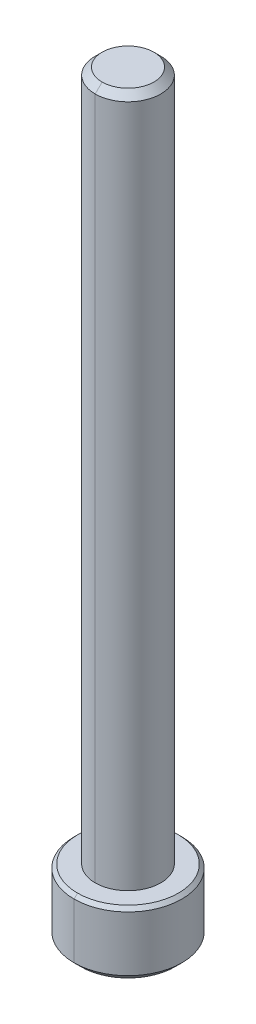
ISO-10303-21;
HEADER;
FILE_DESCRIPTION(('STEP AP214'),'2;1');
FILE_NAME('part.step','',(''),(''),'','','');
FILE_SCHEMA(('AUTOMOTIVE_DESIGN { 1 0 10303 214 1 1 1 1 }'));
ENDSEC;
DATA;
#1=APPLICATION_CONTEXT('core data for automotive mechanical design processes');
#2=APPLICATION_PROTOCOL_DEFINITION('international standard','automotive_design',2000,#1);
#3=PRODUCT_CONTEXT('',#1,'mechanical');
#4=PRODUCT('Part','Part','',(#3));
#5=PRODUCT_RELATED_PRODUCT_CATEGORY('part','',(#4));
#6=PRODUCT_DEFINITION_FORMATION('','',#4);
#7=PRODUCT_DEFINITION_CONTEXT('part definition',#1,'design');
#8=PRODUCT_DEFINITION('design','',#6,#7);
#9=PRODUCT_DEFINITION_SHAPE('','',#8);
#10=(LENGTH_UNIT() NAMED_UNIT(*) SI_UNIT(.MILLI.,.METRE.));
#11=(NAMED_UNIT(*) PLANE_ANGLE_UNIT() SI_UNIT($,.RADIAN.));
#12=(NAMED_UNIT(*) SI_UNIT($,.STERADIAN.) SOLID_ANGLE_UNIT());
#13=UNCERTAINTY_MEASURE_WITH_UNIT(LENGTH_MEASURE(1.E-05),#10,'distance_accuracy_value','');
#14=(GEOMETRIC_REPRESENTATION_CONTEXT(3) GLOBAL_UNCERTAINTY_ASSIGNED_CONTEXT((#13)) GLOBAL_UNIT_ASSIGNED_CONTEXT((#10,
#11,#12)) REPRESENTATION_CONTEXT('',''));
#15=CARTESIAN_POINT('',(0.,0.,0.));
#16=DIRECTION('',(0.,0.,1.));
#17=DIRECTION('',(1.,0.,0.));
#18=AXIS2_PLACEMENT_3D('',#15,#16,#17);
#19=CARTESIAN_POINT('',(0.,-0.254,0.));
#20=DIRECTION('',(0.,-1.,0.));
#21=DIRECTION('',(0.,0.,-1.));
#22=AXIS2_PLACEMENT_3D('',#19,#20,#21);
#23=CONICAL_SURFACE('',#22,3.96875,0.785398163397448);
#24=DIRECTION('',(0.,-0.707106781186548,0.707106781186548));
#25=VECTOR('',#24,1.);
#26=CARTESIAN_POINT('',(0.,-0.254,3.96875));
#27=LINE('',#26,#25);
#28=CARTESIAN_POINT('',(0.,0.,3.71475));
#29=VERTEX_POINT('',#28);
#30=CARTESIAN_POINT('',(0.,-0.254,3.96875));
#31=VERTEX_POINT('',#30);
#32=EDGE_CURVE('E422',#29,#31,#27,.T.);
#33=ORIENTED_EDGE('',*,*,#32,.F.);
#34=CARTESIAN_POINT('',(0.,0.,0.));
#35=DIRECTION('',(0.,1.,0.));
#36=DIRECTION('',(0.,0.,-1.));
#37=AXIS2_PLACEMENT_3D('',#34,#35,#36);
#38=CIRCLE('',#37,3.71475);
#39=CARTESIAN_POINT('',(0.,0.,-3.71475));
#40=VERTEX_POINT('',#39);
#41=EDGE_CURVE('E425',#40,#29,#38,.T.);
#42=ORIENTED_EDGE('',*,*,#41,.F.);
#43=DIRECTION('',(0.,-0.707106781186548,-0.707106781186548));
#44=VECTOR('',#43,1.);
#45=CARTESIAN_POINT('',(0.,-0.254,-3.96875));
#46=LINE('',#45,#44);
#47=CARTESIAN_POINT('',(0.,-0.254,-3.96875));
#48=VERTEX_POINT('',#47);
#49=EDGE_CURVE('E436',#40,#48,#46,.T.);
#50=ORIENTED_EDGE('',*,*,#49,.T.);
#51=CARTESIAN_POINT('',(0.,-0.254,0.));
#52=DIRECTION('',(0.,-1.,0.));
#53=DIRECTION('',(0.,0.,-1.));
#54=AXIS2_PLACEMENT_3D('',#51,#52,#53);
#55=CIRCLE('',#54,3.96875);
#56=EDGE_CURVE('E427',#31,#48,#55,.T.);
#57=ORIENTED_EDGE('',*,*,#56,.F.);
#58=EDGE_LOOP('',(#33,#42,#50,#57));
#59=FACE_BOUND('',#58,.T.);
#60=ADVANCED_FACE('F16',(#59),#23,.T.);
#61=CARTESIAN_POINT('',(0.,-4.826,0.));
#62=DIRECTION('',(0.,1.,0.));
#63=DIRECTION('',(0.,0.,1.));
#64=AXIS2_PLACEMENT_3D('',#61,#62,#63);
#65=CONICAL_SURFACE('',#64,3.46075,0.785398163397448);
#66=DIRECTION('',(0.,0.707106781186548,-0.707106781186548));
#67=VECTOR('',#66,1.);
#68=CARTESIAN_POINT('',(0.,-4.826,-3.46075));
#69=LINE('',#68,#67);
#70=CARTESIAN_POINT('',(0.,-4.826,-3.46075));
#71=VERTEX_POINT('',#70);
#72=CARTESIAN_POINT('',(0.,-4.318,-3.96875));
#73=VERTEX_POINT('',#72);
#74=EDGE_CURVE('E893',#71,#73,#69,.T.);
#75=ORIENTED_EDGE('',*,*,#74,.F.);
#76=CARTESIAN_POINT('',(0.,-4.826,0.));
#77=DIRECTION('',(0.,-1.,0.));
#78=DIRECTION('',(0.,0.,-1.));
#79=AXIS2_PLACEMENT_3D('',#76,#77,#78);
#80=CIRCLE('',#79,3.46075);
#81=CARTESIAN_POINT('',(0.,-4.826,3.46075));
#82=VERTEX_POINT('',#81);
#83=EDGE_CURVE('E114',#82,#71,#80,.T.);
#84=ORIENTED_EDGE('',*,*,#83,.F.);
#85=DIRECTION('',(0.,0.707106781186548,0.707106781186548));
#86=VECTOR('',#85,1.);
#87=CARTESIAN_POINT('',(0.,-4.826,3.46075));
#88=LINE('',#87,#86);
#89=CARTESIAN_POINT('',(0.,-4.318,3.96875));
#90=VERTEX_POINT('',#89);
#91=EDGE_CURVE('E475',#82,#90,#88,.T.);
#92=ORIENTED_EDGE('',*,*,#91,.T.);
#93=CARTESIAN_POINT('',(0.,-4.318,0.));
#94=DIRECTION('',(0.,1.,0.));
#95=DIRECTION('',(0.,0.,-1.));
#96=AXIS2_PLACEMENT_3D('',#93,#94,#95);
#97=CIRCLE('',#96,3.96875);
#98=EDGE_CURVE('E492',#73,#90,#97,.T.);
#99=ORIENTED_EDGE('',*,*,#98,.F.);
#100=EDGE_LOOP('',(#75,#84,#92,#99));
#101=FACE_BOUND('',#100,.T.);
#102=ADVANCED_FACE('F250',(#101),#65,.T.);
#103=CARTESIAN_POINT('',(1.984375,-1.8494248,-1.14567944042316));
#104=DIRECTION('',(1.,0.,0.));
#105=DIRECTION('',(0.,0.,-1.));
#106=AXIS2_PLACEMENT_3D('',#103,#104,#105);
#107=PLANE('',#106);
#108=DIRECTION('',(0.,-1.,0.));
#109=VECTOR('',#108,1.);
#110=CARTESIAN_POINT('',(1.984375,-1.8494248,-1.14567944042316));
#111=LINE('',#110,#109);
#112=CARTESIAN_POINT('',(1.984375,-1.8494248,-1.14567944042316));
#113=VERTEX_POINT('',#112);
#114=CARTESIAN_POINT('',(1.984375,-4.826,-1.14567944042316));
#115=VERTEX_POINT('',#114);
#116=EDGE_CURVE('E11',#113,#115,#111,.T.);
#117=ORIENTED_EDGE('',*,*,#116,.T.);
#118=CARTESIAN_POINT('',(1.984375,-4.826,-1.14567944042316));
#119=CARTESIAN_POINT('',(1.984375,-4.68036208510538,-0.854403610634551));
#120=CARTESIAN_POINT('',(1.984375,-4.60506326337506,-0.590680721420027));
#121=CARTESIAN_POINT('',(1.984375,-4.51924433500676,-0.29011272820971));
#122=CARTESIAN_POINT('',(1.984375,-4.51901637621626,-0.00101005810057195));
#123=CARTESIAN_POINT('',(1.984375,-4.51878865540112,0.287790806093884));
#124=CARTESIAN_POINT('',(1.984375,-4.60492537223951,0.590197211066081));
#125=CARTESIAN_POINT('',(1.984375,-4.67994195088672,0.853563342196651));
#126=CARTESIAN_POINT('',(1.984375,-4.826,1.14567944042317));
#127=B_SPLINE_CURVE_WITH_KNOTS('',2,(#118,#119,#120,#121,#122,#123,#124,#125,#126),
.UNSPECIFIED.,.F.,.F.,(3,2,2,2,3),(0.,0.25,0.5,0.75,1.),.UNSPECIFIED.);
#128=CARTESIAN_POINT('',(1.984375,-4.826,1.14567944042316));
#129=VERTEX_POINT('',#128);
#130=EDGE_CURVE('E267',#115,#129,#127,.T.);
#131=ORIENTED_EDGE('',*,*,#130,.T.);
#132=DIRECTION('',(0.,-1.,0.));
#133=VECTOR('',#132,1.);
#134=CARTESIAN_POINT('',(1.984375,-1.8494248,1.14567944042316));
#135=LINE('',#134,#133);
#136=CARTESIAN_POINT('',(1.984375,-1.8494248,1.14567944042316));
#137=VERTEX_POINT('',#136);
#138=EDGE_CURVE('E345',#137,#129,#135,.T.);
#139=ORIENTED_EDGE('',*,*,#138,.F.);
#140=DIRECTION('',(0.,0.,1.));
#141=VECTOR('',#140,1.);
#142=CARTESIAN_POINT('',(1.984375,-1.8494248,-1.14567944042316));
#143=LINE('',#142,#141);
#144=EDGE_CURVE('E446',#113,#137,#143,.T.);
#145=ORIENTED_EDGE('',*,*,#144,.F.);
#146=EDGE_LOOP('',(#117,#131,#139,#145));
#147=FACE_BOUND('',#146,.T.);
#148=ADVANCED_FACE('F245',(#147),#107,.F.);
#149=CARTESIAN_POINT('',(0.,-1.8494248,-2.29135888084633));
#150=DIRECTION('',(0.5,0.,-0.866025403784439));
#151=DIRECTION('',(0.,-1.,0.));
#152=AXIS2_PLACEMENT_3D('',#149,#150,#151);
#153=PLANE('',#152);
#154=DIRECTION('',(0.,-1.,0.));
#155=VECTOR('',#154,1.);
#156=CARTESIAN_POINT('',(0.,-1.8494248,-2.29135888084633));
#157=LINE('',#156,#155);
#158=CARTESIAN_POINT('',(0.,-1.8494248,-2.29135888084633));
#159=VERTEX_POINT('',#158);
#160=CARTESIAN_POINT('',(0.,-4.826,-2.29135888084633));
#161=VERTEX_POINT('',#160);
#162=EDGE_CURVE('E28',#159,#161,#157,.T.);
#163=ORIENTED_EDGE('',*,*,#162,.T.);
#164=CARTESIAN_POINT('',(0.,-4.826,-2.29135888084633));
#165=CARTESIAN_POINT('',(0.250705601837018,-4.68125505329205,-2.14661393413838));
#166=CARTESIAN_POINT('',(0.477795416201183,-4.60600373712399,-2.01550356868501));
#167=CARTESIAN_POINT('',(0.738188216368874,-4.51971672778291,-1.86516571541315));
#168=CARTESIAN_POINT('',(0.98853321615525,-4.51902060546134,-1.72062896239621));
#169=CARTESIAN_POINT('',(1.23842353131887,-4.51832574745947,-1.57635472166861));
#170=CARTESIAN_POINT('',(1.49993800055402,-4.60381766270318,-1.42536927245872));
#171=CARTESIAN_POINT('',(1.72956436293042,-4.67888501009477,-1.29279443032767));
#172=CARTESIAN_POINT('',(1.984375,-4.826,-1.14567944042316));
#173=B_SPLINE_CURVE_WITH_KNOTS('',2,(#164,#165,#166,#167,#168,#169,#170,#171,#172),
.UNSPECIFIED.,.F.,.F.,(3,2,2,2,3),(0.,0.25,0.5,0.75,1.),.UNSPECIFIED.);
#174=EDGE_CURVE('E390',#161,#115,#173,.T.);
#175=ORIENTED_EDGE('',*,*,#174,.T.);
#176=ORIENTED_EDGE('',*,*,#116,.F.);
#177=DIRECTION('',(0.866025403784439,0.,0.5));
#178=VECTOR('',#177,1.);
#179=CARTESIAN_POINT('',(0.,-1.8494248,-2.29135888084633));
#180=LINE('',#179,#178);
#181=EDGE_CURVE('E450',#159,#113,#180,.T.);
#182=ORIENTED_EDGE('',*,*,#181,.F.);
#183=EDGE_LOOP('',(#163,#175,#176,#182));
#184=FACE_BOUND('',#183,.T.);
#185=ADVANCED_FACE('F249',(#184),#153,.F.);
#186=CARTESIAN_POINT('',(-1.984375,-1.8494248,-1.14567944042316));
#187=DIRECTION('',(-0.5,0.,-0.866025403784439));
#188=DIRECTION('',(-0.866025403784439,0.,0.5));
#189=AXIS2_PLACEMENT_3D('',#186,#187,#188);
#190=PLANE('',#189);
#191=DIRECTION('',(0.,-1.,0.));
#192=VECTOR('',#191,1.);
#193=CARTESIAN_POINT('',(-1.984375,-1.8494248,-1.14567944042316));
#194=LINE('',#193,#192);
#195=CARTESIAN_POINT('',(-1.984375,-1.8494248,-1.14567944042316));
#196=VERTEX_POINT('',#195);
#197=CARTESIAN_POINT('',(-1.984375,-4.826,-1.14567944042316));
#198=VERTEX_POINT('',#197);
#199=EDGE_CURVE('E159',#196,#198,#194,.T.);
#200=ORIENTED_EDGE('',*,*,#199,.T.);
#201=CARTESIAN_POINT('',(-1.984375,-4.826,-1.14567944042316));
#202=CARTESIAN_POINT('',(-1.73366939816202,-4.6812550532915,-1.29042438713167));
#203=CARTESIAN_POINT('',(-1.50657958379882,-4.606003737124,-1.42153475258448));
#204=CARTESIAN_POINT('',(-1.24618678363029,-4.51971672778291,-1.57187260585682));
#205=CARTESIAN_POINT('',(-0.99584178384475,-4.51902060546134,-1.71640935887328));
#206=CARTESIAN_POINT('',(-0.745951468679565,-4.51832574745947,-1.86068359960178));
#207=CARTESIAN_POINT('',(-0.484436999445984,-4.60381766270318,-2.01166904881077));
#208=CARTESIAN_POINT('',(-0.254810637067759,-4.67888501009583,-2.14424389094287));
#209=CARTESIAN_POINT('',(0.,-4.826,-2.29135888084632));
#210=B_SPLINE_CURVE_WITH_KNOTS('',2,(#201,#202,#203,#204,#205,#206,#207,#208,#209),
.UNSPECIFIED.,.F.,.F.,(3,2,2,2,3),(0.,0.25,0.5,0.75,1.),.UNSPECIFIED.);
#211=EDGE_CURVE('E189',#198,#161,#210,.T.);
#212=ORIENTED_EDGE('',*,*,#211,.T.);
#213=ORIENTED_EDGE('',*,*,#162,.F.);
#214=DIRECTION('',(0.866025403784439,0.,-0.5));
#215=VECTOR('',#214,1.);
#216=CARTESIAN_POINT('',(-1.984375,-1.8494248,-1.14567944042316));
#217=LINE('',#216,#215);
#218=EDGE_CURVE('E454',#196,#159,#217,.T.);
#219=ORIENTED_EDGE('',*,*,#218,.F.);
#220=EDGE_LOOP('',(#200,#212,#213,#219));
#221=FACE_BOUND('',#220,.T.);
#222=ADVANCED_FACE('F242',(#221),#190,.F.);
#223=CARTESIAN_POINT('',(-1.984375,-1.8494248,1.14567944042316));
#224=DIRECTION('',(-1.,0.,0.));
#225=DIRECTION('',(0.,0.,1.));
#226=AXIS2_PLACEMENT_3D('',#223,#224,#225);
#227=PLANE('',#226);
#228=DIRECTION('',(0.,-1.,0.));
#229=VECTOR('',#228,1.);
#230=CARTESIAN_POINT('',(-1.984375,-1.8494248,1.14567944042316));
#231=LINE('',#230,#229);
#232=CARTESIAN_POINT('',(-1.984375,-1.8494248,1.14567944042316));
#233=VERTEX_POINT('',#232);
#234=CARTESIAN_POINT('',(-1.984375,-4.826,1.14567944042316));
#235=VERTEX_POINT('',#234);
#236=EDGE_CURVE('E167',#233,#235,#231,.T.);
#237=ORIENTED_EDGE('',*,*,#236,.T.);
#238=CARTESIAN_POINT('',(-1.984375,-4.826,1.14567944042316));
#239=CARTESIAN_POINT('',(-1.984375,-4.68036208510536,0.854403610634491));
#240=CARTESIAN_POINT('',(-1.984375,-4.60506326337506,0.590680721420027));
#241=CARTESIAN_POINT('',(-1.984375,-4.51924433500676,0.290112728209678));
#242=CARTESIAN_POINT('',(-1.984375,-4.51901637621626,0.00101005810056978));
#243=CARTESIAN_POINT('',(-1.984375,-4.51878865540112,-0.287790806093884));
#244=CARTESIAN_POINT('',(-1.984375,-4.60492537223951,-0.590197211066078));
#245=CARTESIAN_POINT('',(-1.984375,-4.67994195088672,-0.853563342196648));
#246=CARTESIAN_POINT('',(-1.984375,-4.826,-1.14567944042316));
#247=B_SPLINE_CURVE_WITH_KNOTS('',2,(#238,#239,#240,#241,#242,#243,#244,#245,#246),
.UNSPECIFIED.,.F.,.F.,(3,2,2,2,3),(0.,0.25,0.5,0.75,1.),.UNSPECIFIED.);
#248=EDGE_CURVE('E170',#235,#198,#247,.T.);
#249=ORIENTED_EDGE('',*,*,#248,.T.);
#250=ORIENTED_EDGE('',*,*,#199,.F.);
#251=DIRECTION('',(0.,0.,-1.));
#252=VECTOR('',#251,1.);
#253=CARTESIAN_POINT('',(-1.984375,-1.8494248,1.14567944042316));
#254=LINE('',#253,#252);
#255=EDGE_CURVE('E174',#233,#196,#254,.T.);
#256=ORIENTED_EDGE('',*,*,#255,.F.);
#257=EDGE_LOOP('',(#237,#249,#250,#256));
#258=FACE_BOUND('',#257,.T.);
#259=ADVANCED_FACE('F169',(#258),#227,.F.);
#260=CARTESIAN_POINT('',(0.,-1.8494248,2.29135888084633));
#261=DIRECTION('',(-0.5,0.,0.866025403784439));
#262=DIRECTION('',(0.,1.,0.));
#263=AXIS2_PLACEMENT_3D('',#260,#261,#262);
#264=PLANE('',#263);
#265=DIRECTION('',(0.,-1.,0.));
#266=VECTOR('',#265,1.);
#267=CARTESIAN_POINT('',(0.,-1.8494248,2.29135888084633));
#268=LINE('',#267,#266);
#269=CARTESIAN_POINT('',(0.,-1.8494248,2.29135888084633));
#270=VERTEX_POINT('',#269);
#271=CARTESIAN_POINT('',(0.,-4.826,2.29135888084633));
#272=VERTEX_POINT('',#271);
#273=EDGE_CURVE('E180',#270,#272,#268,.T.);
#274=ORIENTED_EDGE('',*,*,#273,.T.);
#275=CARTESIAN_POINT('',(0.,-4.826,2.29135888084633));
#276=CARTESIAN_POINT('',(-0.250705601836271,-4.68125505329248,2.14661393413881));
#277=CARTESIAN_POINT('',(-0.477795416201183,-4.606003737124,2.01550356868501));
#278=CARTESIAN_POINT('',(-0.738188216366829,-4.51971672778338,1.86516571541433));
#279=CARTESIAN_POINT('',(-0.988533216155249,-4.51902060546134,1.72062896239621));
#280=CARTESIAN_POINT('',(-1.23842353131898,-4.518325747459,1.57635472166855));
#281=CARTESIAN_POINT('',(-1.49993800055402,-4.60381766270318,1.42536927245872));
#282=CARTESIAN_POINT('',(-1.72956436293218,-4.67888501009579,1.29279443032665));
#283=CARTESIAN_POINT('',(-1.984375,-4.826,1.14567944042316));
#284=B_SPLINE_CURVE_WITH_KNOTS('',2,(#275,#276,#277,#278,#279,#280,#281,#282,#283),
.UNSPECIFIED.,.F.,.F.,(3,2,2,2,3),(0.,0.25,0.5,0.75,1.),.UNSPECIFIED.);
#285=EDGE_CURVE('E190',#272,#235,#284,.T.);
#286=ORIENTED_EDGE('',*,*,#285,.T.);
#287=ORIENTED_EDGE('',*,*,#236,.F.);
#288=DIRECTION('',(-0.866025403784439,0.,-0.5));
#289=VECTOR('',#288,1.);
#290=CARTESIAN_POINT('',(0.,-1.8494248,2.29135888084633));
#291=LINE('',#290,#289);
#292=EDGE_CURVE('E491',#270,#233,#291,.T.);
#293=ORIENTED_EDGE('',*,*,#292,.F.);
#294=EDGE_LOOP('',(#274,#286,#287,#293));
#295=FACE_BOUND('',#294,.T.);
#296=ADVANCED_FACE('F196',(#295),#264,.F.);
#297=CARTESIAN_POINT('',(1.984375,-1.8494248,1.14567944042316));
#298=DIRECTION('',(0.5,0.,0.866025403784438));
#299=DIRECTION('',(0.,-1.,0.));
#300=AXIS2_PLACEMENT_3D('',#297,#298,#299);
#301=PLANE('',#300);
#302=ORIENTED_EDGE('',*,*,#138,.T.);
#303=CARTESIAN_POINT('',(1.984375,-4.826,1.14567944042316));
#304=CARTESIAN_POINT('',(1.73366939816205,-4.68125505329151,1.29042438713165));
#305=CARTESIAN_POINT('',(1.50657958379882,-4.606003737124,1.42153475258448));
#306=CARTESIAN_POINT('',(1.24618678363103,-4.51971672778314,1.5718726058564));
#307=CARTESIAN_POINT('',(0.995841783844754,-4.51902060546134,1.71640935887328));
#308=CARTESIAN_POINT('',(0.745951468680323,-4.51832574745923,1.86068359960134));
#309=CARTESIAN_POINT('',(0.484436999445986,-4.60381766270318,2.01166904881077));
#310=CARTESIAN_POINT('',(0.254810637067813,-4.67888501009579,2.14424389094284));
#311=CARTESIAN_POINT('',(0.,-4.826,2.29135888084632));
#312=B_SPLINE_CURVE_WITH_KNOTS('',2,(#303,#304,#305,#306,#307,#308,#309,#310,#311),
.UNSPECIFIED.,.F.,.F.,(3,2,2,2,3),(0.,0.25,0.5,0.75,1.),.UNSPECIFIED.);
#313=EDGE_CURVE('E201',#129,#272,#312,.T.);
#314=ORIENTED_EDGE('',*,*,#313,.T.);
#315=ORIENTED_EDGE('',*,*,#273,.F.);
#316=DIRECTION('',(-0.866025403784439,0.,0.5));
#317=VECTOR('',#316,1.);
#318=CARTESIAN_POINT('',(1.984375,-1.8494248,1.14567944042316));
#319=LINE('',#318,#317);
#320=EDGE_CURVE('E526',#137,#270,#319,.T.);
#321=ORIENTED_EDGE('',*,*,#320,.F.);
#322=EDGE_LOOP('',(#302,#314,#315,#321));
#323=FACE_BOUND('',#322,.T.);
#324=ADVANCED_FACE('F326',(#323),#301,.F.);
#325=CARTESIAN_POINT('',(0.,-1.8494248,0.));
#326=DIRECTION('',(0.,-1.,0.));
#327=DIRECTION('',(0.,0.,-1.));
#328=AXIS2_PLACEMENT_3D('',#325,#326,#327);
#329=PLANE('',#328);
#330=ORIENTED_EDGE('',*,*,#144,.T.);
#331=ORIENTED_EDGE('',*,*,#320,.T.);
#332=ORIENTED_EDGE('',*,*,#292,.T.);
#333=ORIENTED_EDGE('',*,*,#255,.T.);
#334=ORIENTED_EDGE('',*,*,#218,.T.);
#335=ORIENTED_EDGE('',*,*,#181,.T.);
#336=EDGE_LOOP('',(#330,#331,#332,#333,#334,#335));
#337=FACE_BOUND('',#336,.T.);
#338=ADVANCED_FACE('F283',(#337),#329,.T.);
#339=CARTESIAN_POINT('',(0.,-4.826,0.));
#340=DIRECTION('',(0.,-1.,0.));
#341=DIRECTION('',(0.,0.,-1.));
#342=AXIS2_PLACEMENT_3D('',#339,#340,#341);
#343=CONICAL_SURFACE('',#342,2.29135888084632,0.78539816339745);
#344=CARTESIAN_POINT('',(0.,-4.826,0.));
#345=DIRECTION('',(0.,-1.,0.));
#346=DIRECTION('',(0.,0.,-1.));
#347=AXIS2_PLACEMENT_3D('',#344,#345,#346);
#348=CIRCLE('',#347,2.29135888084632);
#349=EDGE_CURVE('E496',#115,#129,#348,.T.);
#350=ORIENTED_EDGE('',*,*,#349,.T.);
#351=ORIENTED_EDGE('',*,*,#130,.F.);
#352=EDGE_LOOP('',(#350,#351));
#353=FACE_BOUND('',#352,.T.);
#354=ADVANCED_FACE('F272',(#353),#343,.F.);
#355=CARTESIAN_POINT('',(0.,-4.826,0.));
#356=DIRECTION('',(0.,-1.,0.));
#357=DIRECTION('',(0.,0.,-1.));
#358=AXIS2_PLACEMENT_3D('',#355,#356,#357);
#359=CONICAL_SURFACE('',#358,2.29135888084632,0.78539816339745);
#360=CARTESIAN_POINT('',(0.,-4.826,0.));
#361=DIRECTION('',(0.,-1.,0.));
#362=DIRECTION('',(0.,0.,-1.));
#363=AXIS2_PLACEMENT_3D('',#360,#361,#362);
#364=CIRCLE('',#363,2.29135888084632);
#365=EDGE_CURVE('E223',#161,#115,#364,.T.);
#366=ORIENTED_EDGE('',*,*,#365,.T.);
#367=ORIENTED_EDGE('',*,*,#174,.F.);
#368=EDGE_LOOP('',(#366,#367));
#369=FACE_BOUND('',#368,.T.);
#370=ADVANCED_FACE('F282',(#369),#359,.F.);
#371=CARTESIAN_POINT('',(0.,-4.826,0.));
#372=DIRECTION('',(0.,-1.,0.));
#373=DIRECTION('',(0.,0.,-1.));
#374=AXIS2_PLACEMENT_3D('',#371,#372,#373);
#375=CONICAL_SURFACE('',#374,2.29135888084632,0.78539816339745);
#376=CARTESIAN_POINT('',(0.,-4.826,0.));
#377=DIRECTION('',(0.,-1.,0.));
#378=DIRECTION('',(0.,0.,-1.));
#379=AXIS2_PLACEMENT_3D('',#376,#377,#378);
#380=CIRCLE('',#379,2.29135888084632);
#381=EDGE_CURVE('E215',#198,#161,#380,.T.);
#382=ORIENTED_EDGE('',*,*,#381,.T.);
#383=ORIENTED_EDGE('',*,*,#211,.F.);
#384=EDGE_LOOP('',(#382,#383));
#385=FACE_BOUND('',#384,.T.);
#386=ADVANCED_FACE('F310',(#385),#375,.F.);
#387=CARTESIAN_POINT('',(0.,-4.826,0.));
#388=DIRECTION('',(0.,-1.,0.));
#389=DIRECTION('',(0.,0.,-1.));
#390=AXIS2_PLACEMENT_3D('',#387,#388,#389);
#391=CONICAL_SURFACE('',#390,2.29135888084632,0.78539816339745);
#392=CARTESIAN_POINT('',(0.,-4.826,0.));
#393=DIRECTION('',(0.,-1.,0.));
#394=DIRECTION('',(0.,0.,-1.));
#395=AXIS2_PLACEMENT_3D('',#392,#393,#394);
#396=CIRCLE('',#395,2.29135888084632);
#397=EDGE_CURVE('E186',#235,#198,#396,.T.);
#398=ORIENTED_EDGE('',*,*,#397,.T.);
#399=ORIENTED_EDGE('',*,*,#248,.F.);
#400=EDGE_LOOP('',(#398,#399));
#401=FACE_BOUND('',#400,.T.);
#402=ADVANCED_FACE('F184',(#401),#391,.F.);
#403=CARTESIAN_POINT('',(0.,-4.826,0.));
#404=DIRECTION('',(0.,-1.,0.));
#405=DIRECTION('',(0.,0.,-1.));
#406=AXIS2_PLACEMENT_3D('',#403,#404,#405);
#407=CONICAL_SURFACE('',#406,2.29135888084632,0.78539816339745);
#408=CARTESIAN_POINT('',(0.,-4.826,0.));
#409=DIRECTION('',(0.,-1.,0.));
#410=DIRECTION('',(0.,0.,-1.));
#411=AXIS2_PLACEMENT_3D('',#408,#409,#410);
#412=CIRCLE('',#411,2.29135888084632);
#413=EDGE_CURVE('E205',#272,#235,#412,.T.);
#414=ORIENTED_EDGE('',*,*,#413,.T.);
#415=ORIENTED_EDGE('',*,*,#285,.F.);
#416=EDGE_LOOP('',(#414,#415));
#417=FACE_BOUND('',#416,.T.);
#418=ADVANCED_FACE('F206',(#417),#407,.F.);
#419=CARTESIAN_POINT('',(0.,-4.826,0.));
#420=DIRECTION('',(0.,-1.,0.));
#421=DIRECTION('',(0.,0.,-1.));
#422=AXIS2_PLACEMENT_3D('',#419,#420,#421);
#423=CONICAL_SURFACE('',#422,2.29135888084632,0.78539816339745);
#424=CARTESIAN_POINT('',(0.,-4.826,0.));
#425=DIRECTION('',(0.,-1.,0.));
#426=DIRECTION('',(0.,0.,-1.));
#427=AXIS2_PLACEMENT_3D('',#424,#425,#426);
#428=CIRCLE('',#427,2.29135888084632);
#429=EDGE_CURVE('E210',#129,#272,#428,.T.);
#430=ORIENTED_EDGE('',*,*,#429,.T.);
#431=ORIENTED_EDGE('',*,*,#313,.F.);
#432=EDGE_LOOP('',(#430,#431));
#433=FACE_BOUND('',#432,.T.);
#434=ADVANCED_FACE('F405',(#433),#423,.F.);
#435=CARTESIAN_POINT('',(0.,0.,0.));
#436=DIRECTION('',(0.,-1.,0.));
#437=DIRECTION('',(0.,0.,-1.));
#438=AXIS2_PLACEMENT_3D('',#435,#436,#437);
#439=PLANE('',#438);
#440=CARTESIAN_POINT('',(0.,0.,0.));
#441=DIRECTION('',(0.,1.,0.));
#442=DIRECTION('',(0.,0.,1.));
#443=AXIS2_PLACEMENT_3D('',#440,#441,#442);
#444=CIRCLE('',#443,2.413);
#445=CARTESIAN_POINT('',(0.,0.,-2.413));
#446=VERTEX_POINT('',#445);
#447=CARTESIAN_POINT('',(0.,0.,2.413));
#448=VERTEX_POINT('',#447);
#449=EDGE_CURVE('E871',#446,#448,#444,.T.);
#450=ORIENTED_EDGE('',*,*,#449,.F.);
#451=CARTESIAN_POINT('',(0.,0.,0.));
#452=DIRECTION('',(0.,1.,0.));
#453=DIRECTION('',(0.,0.,1.));
#454=AXIS2_PLACEMENT_3D('',#451,#452,#453);
#455=CIRCLE('',#454,2.413);
#456=EDGE_CURVE('E460',#448,#446,#455,.T.);
#457=ORIENTED_EDGE('',*,*,#456,.F.);
#458=EDGE_LOOP('',(#450,#457));
#459=FACE_BOUND('',#458,.T.);
#460=ORIENTED_EDGE('',*,*,#41,.T.);
#461=CARTESIAN_POINT('',(0.,0.,0.));
#462=DIRECTION('',(0.,1.,0.));
#463=DIRECTION('',(0.,0.,-1.));
#464=AXIS2_PLACEMENT_3D('',#461,#462,#463);
#465=CIRCLE('',#464,3.71475);
#466=EDGE_CURVE('E433',#29,#40,#465,.T.);
#467=ORIENTED_EDGE('',*,*,#466,.T.);
#468=EDGE_LOOP('',(#460,#467));
#469=FACE_BOUND('',#468,.T.);
#470=ADVANCED_FACE('F368',(#459,#469),#439,.F.);
#471=CARTESIAN_POINT('',(0.,-4.826,0.));
#472=DIRECTION('',(0.,-1.,0.));
#473=DIRECTION('',(0.,0.,-1.));
#474=AXIS2_PLACEMENT_3D('',#471,#472,#473);
#475=PLANE('',#474);
#476=ORIENTED_EDGE('',*,*,#365,.F.);
#477=ORIENTED_EDGE('',*,*,#381,.F.);
#478=ORIENTED_EDGE('',*,*,#397,.F.);
#479=ORIENTED_EDGE('',*,*,#413,.F.);
#480=ORIENTED_EDGE('',*,*,#429,.F.);
#481=ORIENTED_EDGE('',*,*,#349,.F.);
#482=EDGE_LOOP('',(#476,#477,#478,#479,#480,#481));
#483=FACE_BOUND('',#482,.T.);
#484=ORIENTED_EDGE('',*,*,#83,.T.);
#485=CARTESIAN_POINT('',(0.,-4.826,0.));
#486=DIRECTION('',(0.,-1.,0.));
#487=DIRECTION('',(0.,0.,-1.));
#488=AXIS2_PLACEMENT_3D('',#485,#486,#487);
#489=CIRCLE('',#488,3.46075);
#490=EDGE_CURVE('E449',#71,#82,#489,.T.);
#491=ORIENTED_EDGE('',*,*,#490,.T.);
#492=EDGE_LOOP('',(#484,#491));
#493=FACE_BOUND('',#492,.T.);
#494=ADVANCED_FACE('F213',(#483,#493),#475,.T.);
#495=CARTESIAN_POINT('',(0.,-4.826,0.));
#496=DIRECTION('',(0.,1.,0.));
#497=DIRECTION('',(0.,0.,1.));
#498=AXIS2_PLACEMENT_3D('',#495,#496,#497);
#499=CYLINDRICAL_SURFACE('',#498,3.96875);
#500=DIRECTION('',(0.,1.,0.));
#501=VECTOR('',#500,1.);
#502=CARTESIAN_POINT('',(0.,-4.826,-3.96875));
#503=LINE('',#502,#501);
#504=EDGE_CURVE('E464',#73,#48,#503,.T.);
#505=ORIENTED_EDGE('',*,*,#504,.F.);
#506=ORIENTED_EDGE('',*,*,#98,.T.);
#507=DIRECTION('',(0.,1.,0.));
#508=VECTOR('',#507,1.);
#509=CARTESIAN_POINT('',(0.,-4.826,3.96875));
#510=LINE('',#509,#508);
#511=EDGE_CURVE('E462',#90,#31,#510,.T.);
#512=ORIENTED_EDGE('',*,*,#511,.T.);
#513=ORIENTED_EDGE('',*,*,#56,.T.);
#514=EDGE_LOOP('',(#505,#506,#512,#513));
#515=FACE_BOUND('',#514,.T.);
#516=ADVANCED_FACE('F367',(#515),#499,.T.);
#517=CARTESIAN_POINT('',(0.,50.8,0.));
#518=DIRECTION('',(0.,-1.,0.));
#519=DIRECTION('',(0.,0.,-1.));
#520=AXIS2_PLACEMENT_3D('',#517,#518,#519);
#521=CONICAL_SURFACE('',#520,1.905,0.78539816339745);
#522=DIRECTION('',(0.,-0.707106781186547,0.707106781186548));
#523=VECTOR('',#522,1.);
#524=CARTESIAN_POINT('',(0.,50.8,1.905));
#525=LINE('',#524,#523);
#526=CARTESIAN_POINT('',(0.,50.8,1.905));
#527=VERTEX_POINT('',#526);
#528=CARTESIAN_POINT('',(0.,50.292,2.413));
#529=VERTEX_POINT('',#528);
#530=EDGE_CURVE('E471',#527,#529,#525,.T.);
#531=ORIENTED_EDGE('',*,*,#530,.F.);
#532=CARTESIAN_POINT('',(0.,50.8,0.));
#533=DIRECTION('',(0.,1.,0.));
#534=DIRECTION('',(0.,0.,1.));
#535=AXIS2_PLACEMENT_3D('',#532,#533,#534);
#536=CIRCLE('',#535,1.905);
#537=CARTESIAN_POINT('',(0.,50.8,-1.905));
#538=VERTEX_POINT('',#537);
#539=EDGE_CURVE('E494',#538,#527,#536,.T.);
#540=ORIENTED_EDGE('',*,*,#539,.F.);
#541=DIRECTION('',(0.,-0.707106781186547,-0.707106781186548));
#542=VECTOR('',#541,1.);
#543=CARTESIAN_POINT('',(0.,50.8,-1.905));
#544=LINE('',#543,#542);
#545=CARTESIAN_POINT('',(0.,50.292,-2.413));
#546=VERTEX_POINT('',#545);
#547=EDGE_CURVE('E461',#538,#546,#544,.T.);
#548=ORIENTED_EDGE('',*,*,#547,.T.);
#549=CARTESIAN_POINT('',(0.,50.292,0.));
#550=DIRECTION('',(0.,-1.,0.));
#551=DIRECTION('',(0.,0.,1.));
#552=AXIS2_PLACEMENT_3D('',#549,#550,#551);
#553=CIRCLE('',#552,2.413);
#554=EDGE_CURVE('E573',#529,#546,#553,.T.);
#555=ORIENTED_EDGE('',*,*,#554,.F.);
#556=EDGE_LOOP('',(#531,#540,#548,#555));
#557=FACE_BOUND('',#556,.T.);
#558=ADVANCED_FACE('F243',(#557),#521,.T.);
#559=CARTESIAN_POINT('',(0.,50.8,0.));
#560=DIRECTION('',(0.,1.,0.));
#561=DIRECTION('',(1.,0.,0.));
#562=AXIS2_PLACEMENT_3D('',#559,#560,#561);
#563=PLANE('',#562);
#564=ORIENTED_EDGE('',*,*,#539,.T.);
#565=CARTESIAN_POINT('',(0.,50.8,0.));
#566=DIRECTION('',(0.,1.,0.));
#567=DIRECTION('',(0.,0.,1.));
#568=AXIS2_PLACEMENT_3D('',#565,#566,#567);
#569=CIRCLE('',#568,1.905);
#570=EDGE_CURVE('E463',#527,#538,#569,.T.);
#571=ORIENTED_EDGE('',*,*,#570,.T.);
#572=EDGE_LOOP('',(#564,#571));
#573=FACE_BOUND('',#572,.T.);
#574=ADVANCED_FACE('F364',(#573),#563,.T.);
#575=CARTESIAN_POINT('',(0.,50.8,0.));
#576=DIRECTION('',(0.,-1.,0.));
#577=DIRECTION('',(0.,0.,-1.));
#578=AXIS2_PLACEMENT_3D('',#575,#576,#577);
#579=CYLINDRICAL_SURFACE('',#578,2.413);
#580=DIRECTION('',(0.,-1.,0.));
#581=VECTOR('',#580,1.);
#582=CARTESIAN_POINT('',(0.,50.8,2.413));
#583=LINE('',#582,#581);
#584=EDGE_CURVE('E458',#529,#448,#583,.T.);
#585=ORIENTED_EDGE('',*,*,#584,.F.);
#586=ORIENTED_EDGE('',*,*,#554,.T.);
#587=DIRECTION('',(0.,-1.,0.));
#588=VECTOR('',#587,1.);
#589=CARTESIAN_POINT('',(0.,50.8,-2.413));
#590=LINE('',#589,#588);
#591=EDGE_CURVE('E569',#546,#446,#590,.T.);
#592=ORIENTED_EDGE('',*,*,#591,.T.);
#593=ORIENTED_EDGE('',*,*,#449,.T.);
#594=EDGE_LOOP('',(#585,#586,#592,#593));
#595=FACE_BOUND('',#594,.T.);
#596=ADVANCED_FACE('F322',(#595),#579,.T.);
#597=CARTESIAN_POINT('',(0.,50.8,0.));
#598=DIRECTION('',(0.,-1.,0.));
#599=DIRECTION('',(0.,0.,-1.));
#600=AXIS2_PLACEMENT_3D('',#597,#598,#599);
#601=CYLINDRICAL_SURFACE('',#600,2.413);
#602=CARTESIAN_POINT('',(0.,50.292,0.));
#603=DIRECTION('',(0.,-1.,0.));
#604=DIRECTION('',(0.,0.,1.));
#605=AXIS2_PLACEMENT_3D('',#602,#603,#604);
#606=CIRCLE('',#605,2.413);
#607=EDGE_CURVE('E547',#546,#529,#606,.T.);
#608=ORIENTED_EDGE('',*,*,#607,.T.);
#609=ORIENTED_EDGE('',*,*,#584,.T.);
#610=ORIENTED_EDGE('',*,*,#456,.T.);
#611=ORIENTED_EDGE('',*,*,#591,.F.);
#612=EDGE_LOOP('',(#608,#609,#610,#611));
#613=FACE_BOUND('',#612,.T.);
#614=ADVANCED_FACE('F319',(#613),#601,.T.);
#615=CARTESIAN_POINT('',(0.,50.8,0.));
#616=DIRECTION('',(0.,-1.,0.));
#617=DIRECTION('',(0.,0.,-1.));
#618=AXIS2_PLACEMENT_3D('',#615,#616,#617);
#619=CONICAL_SURFACE('',#618,1.905,0.78539816339745);
#620=ORIENTED_EDGE('',*,*,#570,.F.);
#621=ORIENTED_EDGE('',*,*,#530,.T.);
#622=ORIENTED_EDGE('',*,*,#607,.F.);
#623=ORIENTED_EDGE('',*,*,#547,.F.);
#624=EDGE_LOOP('',(#620,#621,#622,#623));
#625=FACE_BOUND('',#624,.T.);
#626=ADVANCED_FACE('F321',(#625),#619,.T.);
#627=CARTESIAN_POINT('',(0.,-4.826,0.));
#628=DIRECTION('',(0.,1.,0.));
#629=DIRECTION('',(0.,0.,1.));
#630=AXIS2_PLACEMENT_3D('',#627,#628,#629);
#631=CYLINDRICAL_SURFACE('',#630,3.96875);
#632=CARTESIAN_POINT('',(0.,-4.318,0.));
#633=DIRECTION('',(0.,1.,0.));
#634=DIRECTION('',(0.,0.,-1.));
#635=AXIS2_PLACEMENT_3D('',#632,#633,#634);
#636=CIRCLE('',#635,3.96875);
#637=EDGE_CURVE('E484',#90,#73,#636,.T.);
#638=ORIENTED_EDGE('',*,*,#637,.T.);
#639=ORIENTED_EDGE('',*,*,#504,.T.);
#640=CARTESIAN_POINT('',(0.,-0.254,0.));
#641=DIRECTION('',(0.,-1.,0.));
#642=DIRECTION('',(0.,0.,-1.));
#643=AXIS2_PLACEMENT_3D('',#640,#641,#642);
#644=CIRCLE('',#643,3.96875);
#645=EDGE_CURVE('E432',#48,#31,#644,.T.);
#646=ORIENTED_EDGE('',*,*,#645,.T.);
#647=ORIENTED_EDGE('',*,*,#511,.F.);
#648=EDGE_LOOP('',(#638,#639,#646,#647));
#649=FACE_BOUND('',#648,.T.);
#650=ADVANCED_FACE('F251',(#649),#631,.T.);
#651=CARTESIAN_POINT('',(0.,-4.826,0.));
#652=DIRECTION('',(0.,1.,0.));
#653=DIRECTION('',(0.,0.,1.));
#654=AXIS2_PLACEMENT_3D('',#651,#652,#653);
#655=CONICAL_SURFACE('',#654,3.46075,0.785398163397448);
#656=ORIENTED_EDGE('',*,*,#490,.F.);
#657=ORIENTED_EDGE('',*,*,#74,.T.);
#658=ORIENTED_EDGE('',*,*,#637,.F.);
#659=ORIENTED_EDGE('',*,*,#91,.F.);
#660=EDGE_LOOP('',(#656,#657,#658,#659));
#661=FACE_BOUND('',#660,.T.);
#662=ADVANCED_FACE('F286',(#661),#655,.T.);
#663=CARTESIAN_POINT('',(0.,-0.254,0.));
#664=DIRECTION('',(0.,-1.,0.));
#665=DIRECTION('',(0.,0.,-1.));
#666=AXIS2_PLACEMENT_3D('',#663,#664,#665);
#667=CONICAL_SURFACE('',#666,3.96875,0.785398163397448);
#668=ORIENTED_EDGE('',*,*,#466,.F.);
#669=ORIENTED_EDGE('',*,*,#32,.T.);
#670=ORIENTED_EDGE('',*,*,#645,.F.);
#671=ORIENTED_EDGE('',*,*,#49,.F.);
#672=EDGE_LOOP('',(#668,#669,#670,#671));
#673=FACE_BOUND('',#672,.T.);
#674=ADVANCED_FACE('F284',(#673),#667,.T.);
#675=CLOSED_SHELL('',(#60,#102,#148,#185,#222,#259,#296,#324,#338,#354,#370,#386,#402,#418,#434,
#470,#494,#516,#558,#574,#596,#614,#626,#650,#662,#674));
#676=MANIFOLD_SOLID_BREP('B1',#675);
#677=ADVANCED_BREP_SHAPE_REPRESENTATION('',(#18,#676),#14);
#678=SHAPE_DEFINITION_REPRESENTATION(#9,#677);
ENDSEC;
END-ISO-10303-21;
